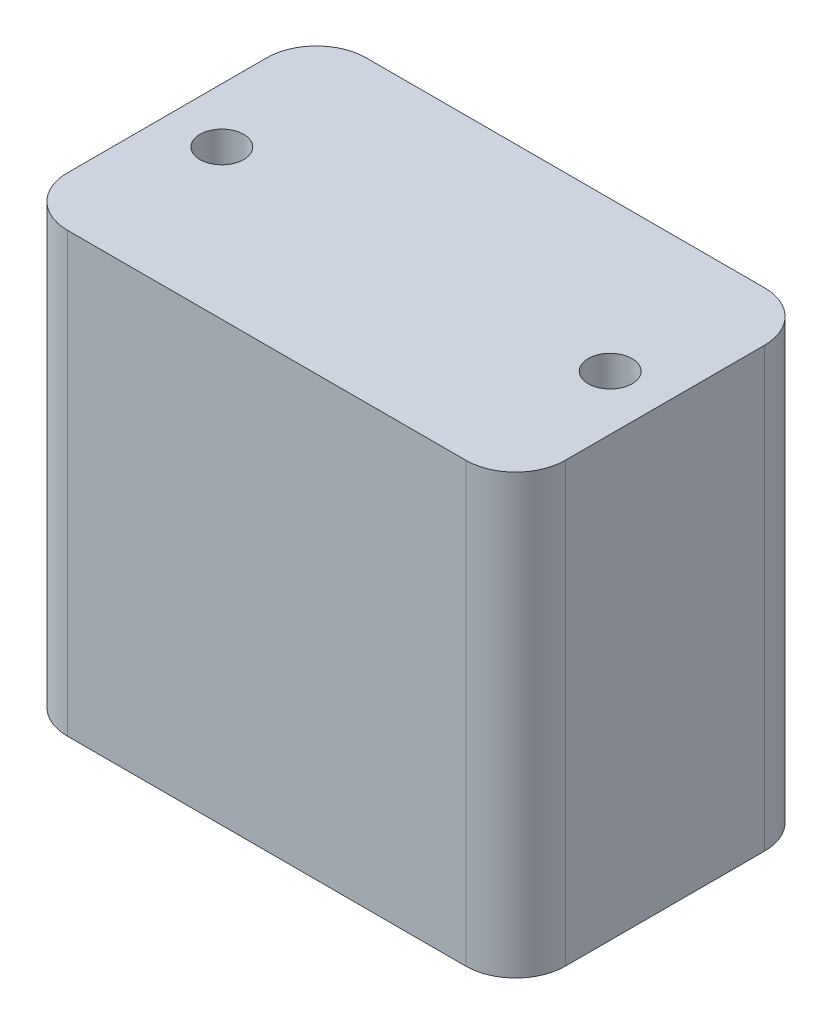
ISO-10303-21;
HEADER;
FILE_DESCRIPTION(('STEP AP214'),'2;1');
FILE_NAME('part.step','',(''),(''),'','','');
FILE_SCHEMA(('AUTOMOTIVE_DESIGN { 1 0 10303 214 1 1 1 1 }'));
ENDSEC;
DATA;
#1=APPLICATION_CONTEXT('core data for automotive mechanical design processes');
#2=APPLICATION_PROTOCOL_DEFINITION('international standard','automotive_design',2000,#1);
#3=PRODUCT_CONTEXT('',#1,'mechanical');
#4=PRODUCT('Part','Part','',(#3));
#5=PRODUCT_RELATED_PRODUCT_CATEGORY('part','',(#4));
#6=PRODUCT_DEFINITION_FORMATION('','',#4);
#7=PRODUCT_DEFINITION_CONTEXT('part definition',#1,'design');
#8=PRODUCT_DEFINITION('design','',#6,#7);
#9=PRODUCT_DEFINITION_SHAPE('','',#8);
#10=(LENGTH_UNIT() NAMED_UNIT(*) SI_UNIT(.MILLI.,.METRE.));
#11=(NAMED_UNIT(*) PLANE_ANGLE_UNIT() SI_UNIT($,.RADIAN.));
#12=(NAMED_UNIT(*) SI_UNIT($,.STERADIAN.) SOLID_ANGLE_UNIT());
#13=UNCERTAINTY_MEASURE_WITH_UNIT(LENGTH_MEASURE(1.E-05),#10,'distance_accuracy_value','');
#14=(GEOMETRIC_REPRESENTATION_CONTEXT(3) GLOBAL_UNCERTAINTY_ASSIGNED_CONTEXT((#13)) GLOBAL_UNIT_ASSIGNED_CONTEXT((#10,
#11,#12)) REPRESENTATION_CONTEXT('',''));
#15=CARTESIAN_POINT('',(0.,0.,0.));
#16=DIRECTION('',(0.,0.,1.));
#17=DIRECTION('',(1.,0.,0.));
#18=AXIS2_PLACEMENT_3D('',#15,#16,#17);
#19=CARTESIAN_POINT('',(20.,44.,10.));
#20=DIRECTION('',(0.,1.,0.));
#21=DIRECTION('',(0.,0.,1.));
#22=AXIS2_PLACEMENT_3D('',#19,#20,#21);
#23=PLANE('',#22);
#24=CARTESIAN_POINT('',(-19.5,44.,0.));
#25=DIRECTION('',(0.,1.,0.));
#26=DIRECTION('',(0.,0.,1.));
#27=AXIS2_PLACEMENT_3D('',#24,#25,#26);
#28=CIRCLE('',#27,2.2);
#29=CARTESIAN_POINT('',(-19.5,44.,2.2));
#30=VERTEX_POINT('',#29);
#31=EDGE_CURVE('E133',#30,#30,#28,.T.);
#32=ORIENTED_EDGE('',*,*,#31,.F.);
#33=EDGE_LOOP('',(#32));
#34=FACE_BOUND('',#33,.T.);
#35=CARTESIAN_POINT('',(20.,44.,10.));
#36=DIRECTION('',(0.,1.,0.));
#37=DIRECTION('',(0.,0.,1.));
#38=AXIS2_PLACEMENT_3D('',#35,#36,#37);
#39=CIRCLE('',#38,5.);
#40=CARTESIAN_POINT('',(20.,44.,15.));
#41=VERTEX_POINT('',#40);
#42=CARTESIAN_POINT('',(25.,44.,9.99999999999996));
#43=VERTEX_POINT('',#42);
#44=EDGE_CURVE('E144',#41,#43,#39,.T.);
#45=ORIENTED_EDGE('',*,*,#44,.T.);
#46=DIRECTION('',(0.,0.,-1.));
#47=VECTOR('',#46,1.);
#48=CARTESIAN_POINT('',(25.,44.,9.99999999999996));
#49=LINE('',#48,#47);
#50=CARTESIAN_POINT('',(25.,44.,-9.99999999999997));
#51=VERTEX_POINT('',#50);
#52=EDGE_CURVE('E92',#43,#51,#49,.T.);
#53=ORIENTED_EDGE('',*,*,#52,.T.);
#54=CARTESIAN_POINT('',(20.,44.,-10.));
#55=DIRECTION('',(0.,1.,0.));
#56=DIRECTION('',(0.,0.,1.));
#57=AXIS2_PLACEMENT_3D('',#54,#55,#56);
#58=CIRCLE('',#57,5.);
#59=CARTESIAN_POINT('',(20.,44.,-15.));
#60=VERTEX_POINT('',#59);
#61=EDGE_CURVE('E159',#51,#60,#58,.T.);
#62=ORIENTED_EDGE('',*,*,#61,.T.);
#63=DIRECTION('',(-1.,0.,0.));
#64=VECTOR('',#63,1.);
#65=CARTESIAN_POINT('',(20.,44.,-15.));
#66=LINE('',#65,#64);
#67=CARTESIAN_POINT('',(-20.,44.,-15.));
#68=VERTEX_POINT('',#67);
#69=EDGE_CURVE('E172',#60,#68,#66,.T.);
#70=ORIENTED_EDGE('',*,*,#69,.T.);
#71=CARTESIAN_POINT('',(-20.,44.,-9.99999999999999));
#72=DIRECTION('',(0.,1.,0.));
#73=DIRECTION('',(0.,0.,1.));
#74=AXIS2_PLACEMENT_3D('',#71,#72,#73);
#75=CIRCLE('',#74,5.);
#76=CARTESIAN_POINT('',(-25.,44.,-9.99999999999996));
#77=VERTEX_POINT('',#76);
#78=EDGE_CURVE('E111',#68,#77,#75,.T.);
#79=ORIENTED_EDGE('',*,*,#78,.T.);
#80=DIRECTION('',(0.,0.,1.));
#81=VECTOR('',#80,1.);
#82=CARTESIAN_POINT('',(-25.,44.,9.99999999999997));
#83=LINE('',#82,#81);
#84=CARTESIAN_POINT('',(-25.,44.,9.99999999999997));
#85=VERTEX_POINT('',#84);
#86=EDGE_CURVE('E105',#77,#85,#83,.T.);
#87=ORIENTED_EDGE('',*,*,#86,.T.);
#88=CARTESIAN_POINT('',(-20.,44.,10.));
#89=DIRECTION('',(0.,1.,0.));
#90=DIRECTION('',(0.,0.,-1.));
#91=AXIS2_PLACEMENT_3D('',#88,#89,#90);
#92=CIRCLE('',#91,5.);
#93=CARTESIAN_POINT('',(-20.,44.,15.));
#94=VERTEX_POINT('',#93);
#95=EDGE_CURVE('E109',#85,#94,#92,.T.);
#96=ORIENTED_EDGE('',*,*,#95,.T.);
#97=DIRECTION('',(1.,0.,0.));
#98=VECTOR('',#97,1.);
#99=CARTESIAN_POINT('',(20.,44.,15.));
#100=LINE('',#99,#98);
#101=EDGE_CURVE('E49',#94,#41,#100,.T.);
#102=ORIENTED_EDGE('',*,*,#101,.T.);
#103=EDGE_LOOP('',(#45,#53,#62,#70,#79,#87,#96,#102));
#104=FACE_BOUND('',#103,.T.);
#105=CARTESIAN_POINT('',(19.5,44.,0.));
#106=DIRECTION('',(0.,1.,0.));
#107=DIRECTION('',(0.,0.,-1.));
#108=AXIS2_PLACEMENT_3D('',#105,#106,#107);
#109=CIRCLE('',#108,2.2);
#110=CARTESIAN_POINT('',(19.5,44.,-2.2));
#111=VERTEX_POINT('',#110);
#112=EDGE_CURVE('E181',#111,#111,#109,.T.);
#113=ORIENTED_EDGE('',*,*,#112,.F.);
#114=EDGE_LOOP('',(#113));
#115=FACE_BOUND('',#114,.T.);
#116=ADVANCED_FACE('F32',(#34,#104,#115),#23,.T.);
#117=CARTESIAN_POINT('',(20.,0.,10.));
#118=DIRECTION('',(0.,1.,0.));
#119=DIRECTION('',(0.,0.,1.));
#120=AXIS2_PLACEMENT_3D('',#117,#118,#119);
#121=PLANE('',#120);
#122=CARTESIAN_POINT('',(20.,0.,10.));
#123=DIRECTION('',(0.,1.,0.));
#124=DIRECTION('',(0.,0.,1.));
#125=AXIS2_PLACEMENT_3D('',#122,#123,#124);
#126=CIRCLE('',#125,5.);
#127=CARTESIAN_POINT('',(20.,0.,15.));
#128=VERTEX_POINT('',#127);
#129=CARTESIAN_POINT('',(25.,0.,9.99999999999996));
#130=VERTEX_POINT('',#129);
#131=EDGE_CURVE('E129',#128,#130,#126,.T.);
#132=ORIENTED_EDGE('',*,*,#131,.F.);
#133=DIRECTION('',(1.,0.,0.));
#134=VECTOR('',#133,1.);
#135=CARTESIAN_POINT('',(20.,0.,15.));
#136=LINE('',#135,#134);
#137=CARTESIAN_POINT('',(-20.,0.,15.));
#138=VERTEX_POINT('',#137);
#139=EDGE_CURVE('E84',#138,#128,#136,.T.);
#140=ORIENTED_EDGE('',*,*,#139,.F.);
#141=CARTESIAN_POINT('',(-20.,0.,10.));
#142=DIRECTION('',(0.,1.,0.));
#143=DIRECTION('',(0.,0.,-1.));
#144=AXIS2_PLACEMENT_3D('',#141,#142,#143);
#145=CIRCLE('',#144,5.);
#146=CARTESIAN_POINT('',(-25.,0.,9.99999999999997));
#147=VERTEX_POINT('',#146);
#148=EDGE_CURVE('E78',#147,#138,#145,.T.);
#149=ORIENTED_EDGE('',*,*,#148,.F.);
#150=DIRECTION('',(0.,0.,1.));
#151=VECTOR('',#150,1.);
#152=CARTESIAN_POINT('',(-25.,0.,9.99999999999997));
#153=LINE('',#152,#151);
#154=CARTESIAN_POINT('',(-25.,0.,-9.99999999999996));
#155=VERTEX_POINT('',#154);
#156=EDGE_CURVE('E119',#155,#147,#153,.T.);
#157=ORIENTED_EDGE('',*,*,#156,.F.);
#158=CARTESIAN_POINT('',(-20.,0.,-9.99999999999999));
#159=DIRECTION('',(0.,1.,0.));
#160=DIRECTION('',(0.,0.,1.));
#161=AXIS2_PLACEMENT_3D('',#158,#159,#160);
#162=CIRCLE('',#161,5.);
#163=CARTESIAN_POINT('',(-20.,0.,-15.));
#164=VERTEX_POINT('',#163);
#165=EDGE_CURVE('E139',#164,#155,#162,.T.);
#166=ORIENTED_EDGE('',*,*,#165,.F.);
#167=DIRECTION('',(-1.,0.,0.));
#168=VECTOR('',#167,1.);
#169=CARTESIAN_POINT('',(20.,0.,-15.));
#170=LINE('',#169,#168);
#171=CARTESIAN_POINT('',(20.,0.,-15.));
#172=VERTEX_POINT('',#171);
#173=EDGE_CURVE('E137',#172,#164,#170,.T.);
#174=ORIENTED_EDGE('',*,*,#173,.F.);
#175=CARTESIAN_POINT('',(20.,0.,-10.));
#176=DIRECTION('',(0.,1.,0.));
#177=DIRECTION('',(0.,0.,1.));
#178=AXIS2_PLACEMENT_3D('',#175,#176,#177);
#179=CIRCLE('',#178,5.);
#180=CARTESIAN_POINT('',(25.,0.,-9.99999999999997));
#181=VERTEX_POINT('',#180);
#182=EDGE_CURVE('E135',#181,#172,#179,.T.);
#183=ORIENTED_EDGE('',*,*,#182,.F.);
#184=DIRECTION('',(0.,0.,-1.));
#185=VECTOR('',#184,1.);
#186=CARTESIAN_POINT('',(25.,0.,9.99999999999996));
#187=LINE('',#186,#185);
#188=EDGE_CURVE('E132',#130,#181,#187,.T.);
#189=ORIENTED_EDGE('',*,*,#188,.F.);
#190=EDGE_LOOP('',(#132,#140,#149,#157,#166,#174,#183,#189));
#191=FACE_BOUND('',#190,.T.);
#192=CARTESIAN_POINT('',(-19.5,0.,0.));
#193=DIRECTION('',(0.,1.,0.));
#194=DIRECTION('',(0.,0.,1.));
#195=AXIS2_PLACEMENT_3D('',#192,#193,#194);
#196=CIRCLE('',#195,2.2);
#197=CARTESIAN_POINT('',(-19.5,0.,2.2));
#198=VERTEX_POINT('',#197);
#199=EDGE_CURVE('E178',#198,#198,#196,.T.);
#200=ORIENTED_EDGE('',*,*,#199,.T.);
#201=EDGE_LOOP('',(#200));
#202=FACE_BOUND('',#201,.T.);
#203=CARTESIAN_POINT('',(19.5,0.,0.));
#204=DIRECTION('',(0.,1.,0.));
#205=DIRECTION('',(0.,0.,-1.));
#206=AXIS2_PLACEMENT_3D('',#203,#204,#205);
#207=CIRCLE('',#206,2.2);
#208=CARTESIAN_POINT('',(19.5,0.,-2.2));
#209=VERTEX_POINT('',#208);
#210=EDGE_CURVE('E184',#209,#209,#207,.T.);
#211=ORIENTED_EDGE('',*,*,#210,.T.);
#212=EDGE_LOOP('',(#211));
#213=FACE_BOUND('',#212,.T.);
#214=ADVANCED_FACE('F163',(#191,#202,#213),#121,.F.);
#215=CARTESIAN_POINT('',(20.,44.,10.));
#216=DIRECTION('',(0.,-1.,0.));
#217=DIRECTION('',(0.,0.,-1.));
#218=AXIS2_PLACEMENT_3D('',#215,#216,#217);
#219=CYLINDRICAL_SURFACE('',#218,5.);
#220=ORIENTED_EDGE('',*,*,#131,.T.);
#221=DIRECTION('',(0.,-1.,0.));
#222=VECTOR('',#221,1.);
#223=CARTESIAN_POINT('',(25.,44.,9.99999999999996));
#224=LINE('',#223,#222);
#225=EDGE_CURVE('E11',#43,#130,#224,.T.);
#226=ORIENTED_EDGE('',*,*,#225,.F.);
#227=ORIENTED_EDGE('',*,*,#44,.F.);
#228=DIRECTION('',(0.,-1.,0.));
#229=VECTOR('',#228,1.);
#230=CARTESIAN_POINT('',(20.,44.,15.));
#231=LINE('',#230,#229);
#232=EDGE_CURVE('E125',#41,#128,#231,.T.);
#233=ORIENTED_EDGE('',*,*,#232,.T.);
#234=EDGE_LOOP('',(#220,#226,#227,#233));
#235=FACE_BOUND('',#234,.T.);
#236=ADVANCED_FACE('F34',(#235),#219,.T.);
#237=CARTESIAN_POINT('',(25.,44.,9.99999999999996));
#238=DIRECTION('',(-1.,0.,0.));
#239=DIRECTION('',(0.,0.,1.));
#240=AXIS2_PLACEMENT_3D('',#237,#238,#239);
#241=PLANE('',#240);
#242=ORIENTED_EDGE('',*,*,#188,.T.);
#243=DIRECTION('',(0.,-1.,0.));
#244=VECTOR('',#243,1.);
#245=CARTESIAN_POINT('',(25.,44.,-9.99999999999997));
#246=LINE('',#245,#244);
#247=EDGE_CURVE('E41',#51,#181,#246,.T.);
#248=ORIENTED_EDGE('',*,*,#247,.F.);
#249=ORIENTED_EDGE('',*,*,#52,.F.);
#250=ORIENTED_EDGE('',*,*,#225,.T.);
#251=EDGE_LOOP('',(#242,#248,#249,#250));
#252=FACE_BOUND('',#251,.T.);
#253=ADVANCED_FACE('F216',(#252),#241,.F.);
#254=CARTESIAN_POINT('',(20.,44.,-10.));
#255=DIRECTION('',(0.,-1.,0.));
#256=DIRECTION('',(0.,0.,-1.));
#257=AXIS2_PLACEMENT_3D('',#254,#255,#256);
#258=CYLINDRICAL_SURFACE('',#257,5.);
#259=ORIENTED_EDGE('',*,*,#182,.T.);
#260=DIRECTION('',(0.,-1.,0.));
#261=VECTOR('',#260,1.);
#262=CARTESIAN_POINT('',(20.,44.,-15.));
#263=LINE('',#262,#261);
#264=EDGE_CURVE('E151',#60,#172,#263,.T.);
#265=ORIENTED_EDGE('',*,*,#264,.F.);
#266=ORIENTED_EDGE('',*,*,#61,.F.);
#267=ORIENTED_EDGE('',*,*,#247,.T.);
#268=EDGE_LOOP('',(#259,#265,#266,#267));
#269=FACE_BOUND('',#268,.T.);
#270=ADVANCED_FACE('F157',(#269),#258,.T.);
#271=CARTESIAN_POINT('',(20.,44.,-15.));
#272=DIRECTION('',(0.,0.,1.));
#273=DIRECTION('',(1.,0.,0.));
#274=AXIS2_PLACEMENT_3D('',#271,#272,#273);
#275=PLANE('',#274);
#276=ORIENTED_EDGE('',*,*,#173,.T.);
#277=DIRECTION('',(0.,-1.,0.));
#278=VECTOR('',#277,1.);
#279=CARTESIAN_POINT('',(-20.,44.,-15.));
#280=LINE('',#279,#278);
#281=EDGE_CURVE('E148',#68,#164,#280,.T.);
#282=ORIENTED_EDGE('',*,*,#281,.F.);
#283=ORIENTED_EDGE('',*,*,#69,.F.);
#284=ORIENTED_EDGE('',*,*,#264,.T.);
#285=EDGE_LOOP('',(#276,#282,#283,#284));
#286=FACE_BOUND('',#285,.T.);
#287=ADVANCED_FACE('F168',(#286),#275,.F.);
#288=CARTESIAN_POINT('',(-20.,44.,-9.99999999999999));
#289=DIRECTION('',(0.,-1.,0.));
#290=DIRECTION('',(0.,0.,-1.));
#291=AXIS2_PLACEMENT_3D('',#288,#289,#290);
#292=CYLINDRICAL_SURFACE('',#291,5.);
#293=ORIENTED_EDGE('',*,*,#165,.T.);
#294=DIRECTION('',(0.,-1.,0.));
#295=VECTOR('',#294,1.);
#296=CARTESIAN_POINT('',(-25.,44.,-9.99999999999996));
#297=LINE('',#296,#295);
#298=EDGE_CURVE('E120',#77,#155,#297,.T.);
#299=ORIENTED_EDGE('',*,*,#298,.F.);
#300=ORIENTED_EDGE('',*,*,#78,.F.);
#301=ORIENTED_EDGE('',*,*,#281,.T.);
#302=EDGE_LOOP('',(#293,#299,#300,#301));
#303=FACE_BOUND('',#302,.T.);
#304=ADVANCED_FACE('F171',(#303),#292,.T.);
#305=CARTESIAN_POINT('',(-25.,44.,9.99999999999997));
#306=DIRECTION('',(1.,0.,0.));
#307=DIRECTION('',(0.,0.,-1.));
#308=AXIS2_PLACEMENT_3D('',#305,#306,#307);
#309=PLANE('',#308);
#310=ORIENTED_EDGE('',*,*,#156,.T.);
#311=DIRECTION('',(0.,-1.,0.));
#312=VECTOR('',#311,1.);
#313=CARTESIAN_POINT('',(-25.,44.,9.99999999999997));
#314=LINE('',#313,#312);
#315=EDGE_CURVE('E116',#85,#147,#314,.T.);
#316=ORIENTED_EDGE('',*,*,#315,.F.);
#317=ORIENTED_EDGE('',*,*,#86,.F.);
#318=ORIENTED_EDGE('',*,*,#298,.T.);
#319=EDGE_LOOP('',(#310,#316,#317,#318));
#320=FACE_BOUND('',#319,.T.);
#321=ADVANCED_FACE('F117',(#320),#309,.F.);
#322=CARTESIAN_POINT('',(-20.,44.,10.));
#323=DIRECTION('',(0.,-1.,0.));
#324=DIRECTION('',(0.,0.,-1.));
#325=AXIS2_PLACEMENT_3D('',#322,#323,#324);
#326=CYLINDRICAL_SURFACE('',#325,5.);
#327=ORIENTED_EDGE('',*,*,#148,.T.);
#328=DIRECTION('',(0.,-1.,0.));
#329=VECTOR('',#328,1.);
#330=CARTESIAN_POINT('',(-20.,44.,15.));
#331=LINE('',#330,#329);
#332=EDGE_CURVE('E121',#94,#138,#331,.T.);
#333=ORIENTED_EDGE('',*,*,#332,.F.);
#334=ORIENTED_EDGE('',*,*,#95,.F.);
#335=ORIENTED_EDGE('',*,*,#315,.T.);
#336=EDGE_LOOP('',(#327,#333,#334,#335));
#337=FACE_BOUND('',#336,.T.);
#338=ADVANCED_FACE('F123',(#337),#326,.T.);
#339=CARTESIAN_POINT('',(20.,44.,15.));
#340=DIRECTION('',(0.,0.,-1.));
#341=DIRECTION('',(-1.,0.,0.));
#342=AXIS2_PLACEMENT_3D('',#339,#340,#341);
#343=PLANE('',#342);
#344=ORIENTED_EDGE('',*,*,#139,.T.);
#345=ORIENTED_EDGE('',*,*,#232,.F.);
#346=ORIENTED_EDGE('',*,*,#101,.F.);
#347=ORIENTED_EDGE('',*,*,#332,.T.);
#348=EDGE_LOOP('',(#344,#345,#346,#347));
#349=FACE_BOUND('',#348,.T.);
#350=ADVANCED_FACE('F204',(#349),#343,.F.);
#351=CARTESIAN_POINT('',(-19.5,44.,0.));
#352=DIRECTION('',(0.,-1.,0.));
#353=DIRECTION('',(0.,0.,-1.));
#354=AXIS2_PLACEMENT_3D('',#351,#352,#353);
#355=CYLINDRICAL_SURFACE('',#354,2.2);
#356=ORIENTED_EDGE('',*,*,#31,.T.);
#357=EDGE_LOOP('',(#356));
#358=FACE_BOUND('',#357,.T.);
#359=ORIENTED_EDGE('',*,*,#199,.F.);
#360=EDGE_LOOP('',(#359));
#361=FACE_BOUND('',#360,.T.);
#362=ADVANCED_FACE('F201',(#358,#361),#355,.F.);
#363=CARTESIAN_POINT('',(19.5,44.,0.));
#364=DIRECTION('',(0.,-1.,0.));
#365=DIRECTION('',(0.,0.,-1.));
#366=AXIS2_PLACEMENT_3D('',#363,#364,#365);
#367=CYLINDRICAL_SURFACE('',#366,2.2);
#368=ORIENTED_EDGE('',*,*,#112,.T.);
#369=EDGE_LOOP('',(#368));
#370=FACE_BOUND('',#369,.T.);
#371=ORIENTED_EDGE('',*,*,#210,.F.);
#372=EDGE_LOOP('',(#371));
#373=FACE_BOUND('',#372,.T.);
#374=ADVANCED_FACE('F190',(#370,#373),#367,.F.);
#375=CLOSED_SHELL('',(#116,#214,#236,#253,#270,#287,#304,#321,#338,#350,#362,#374));
#376=MANIFOLD_SOLID_BREP('B2',#375);
#377=ADVANCED_BREP_SHAPE_REPRESENTATION('',(#18,#376),#14);
#378=SHAPE_DEFINITION_REPRESENTATION(#9,#377);
ENDSEC;
END-ISO-10303-21;
